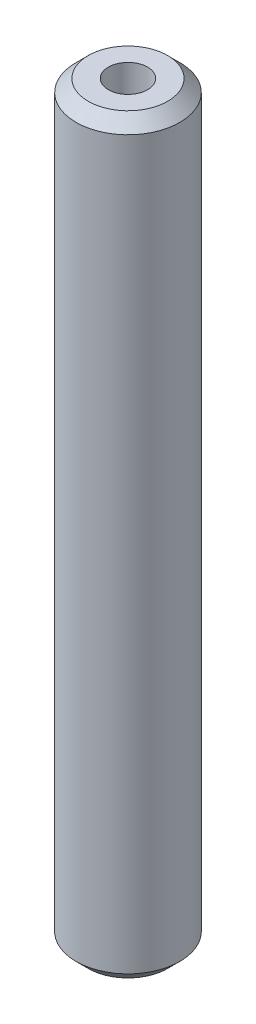
ISO-10303-21;
HEADER;
FILE_DESCRIPTION(('STEP AP214'),'2;1');
FILE_NAME('part.step','',(''),(''),'','','');
FILE_SCHEMA(('AUTOMOTIVE_DESIGN { 1 0 10303 214 1 1 1 1 }'));
ENDSEC;
DATA;
#1=APPLICATION_CONTEXT('core data for automotive mechanical design processes');
#2=APPLICATION_PROTOCOL_DEFINITION('international standard','automotive_design',2000,#1);
#3=PRODUCT_CONTEXT('',#1,'mechanical');
#4=PRODUCT('Part','Part','',(#3));
#5=PRODUCT_RELATED_PRODUCT_CATEGORY('part','',(#4));
#6=PRODUCT_DEFINITION_FORMATION('','',#4);
#7=PRODUCT_DEFINITION_CONTEXT('part definition',#1,'design');
#8=PRODUCT_DEFINITION('design','',#6,#7);
#9=PRODUCT_DEFINITION_SHAPE('','',#8);
#10=(LENGTH_UNIT() NAMED_UNIT(*) SI_UNIT(.MILLI.,.METRE.));
#11=(NAMED_UNIT(*) PLANE_ANGLE_UNIT() SI_UNIT($,.RADIAN.));
#12=(NAMED_UNIT(*) SI_UNIT($,.STERADIAN.) SOLID_ANGLE_UNIT());
#13=UNCERTAINTY_MEASURE_WITH_UNIT(LENGTH_MEASURE(1.E-05),#10,'distance_accuracy_value','');
#14=(GEOMETRIC_REPRESENTATION_CONTEXT(3) GLOBAL_UNCERTAINTY_ASSIGNED_CONTEXT((#13)) GLOBAL_UNIT_ASSIGNED_CONTEXT((#10,
#11,#12)) REPRESENTATION_CONTEXT('',''));
#15=CARTESIAN_POINT('',(0.,0.,0.));
#16=DIRECTION('',(0.,0.,1.));
#17=DIRECTION('',(1.,0.,0.));
#18=AXIS2_PLACEMENT_3D('',#15,#16,#17);
#19=CARTESIAN_POINT('',(0.,108.602294326085,0.));
#20=DIRECTION('',(0.,-1.,0.));
#21=DIRECTION('',(0.,0.,-1.));
#22=AXIS2_PLACEMENT_3D('',#19,#20,#21);
#23=CYLINDRICAL_SURFACE('',#22,7.5);
#24=CARTESIAN_POINT('',(0.,106.841260884572,0.));
#25=DIRECTION('',(0.,1.,0.));
#26=DIRECTION('',(0.,0.,1.));
#27=AXIS2_PLACEMENT_3D('',#24,#25,#26);
#28=CIRCLE('',#27,7.5);
#29=CARTESIAN_POINT('',(0.,106.841260884572,7.5));
#30=VERTEX_POINT('',#29);
#31=EDGE_CURVE('E50',#30,#30,#28,.F.);
#32=ORIENTED_EDGE('',*,*,#31,.T.);
#33=EDGE_LOOP('',(#32));
#34=FACE_BOUND('',#33,.T.);
#35=CARTESIAN_POINT('',(0.,1.76103344151311,0.));
#36=DIRECTION('',(0.,1.,0.));
#37=DIRECTION('',(0.,0.,1.));
#38=AXIS2_PLACEMENT_3D('',#35,#36,#37);
#39=CIRCLE('',#38,7.5);
#40=CARTESIAN_POINT('',(0.,1.76103344151311,7.5));
#41=VERTEX_POINT('',#40);
#42=EDGE_CURVE('E51',#41,#41,#39,.T.);
#43=ORIENTED_EDGE('',*,*,#42,.T.);
#44=EDGE_LOOP('',(#43));
#45=FACE_BOUND('',#44,.T.);
#46=ADVANCED_FACE('F39',(#34,#45),#23,.T.);
#47=CARTESIAN_POINT('',(0.,108.602294326085,0.));
#48=DIRECTION('',(0.,1.,0.));
#49=DIRECTION('',(0.,0.,1.));
#50=AXIS2_PLACEMENT_3D('',#47,#48,#49);
#51=PLANE('',#50);
#52=CARTESIAN_POINT('',(0.,108.602294326085,0.));
#53=DIRECTION('',(0.,1.,0.));
#54=DIRECTION('',(0.,0.,1.));
#55=AXIS2_PLACEMENT_3D('',#52,#53,#54);
#56=CIRCLE('',#55,5.73896655848689);
#57=CARTESIAN_POINT('',(0.,108.602294326085,5.73896655848689));
#58=VERTEX_POINT('',#57);
#59=EDGE_CURVE('E54',#58,#58,#56,.T.);
#60=ORIENTED_EDGE('',*,*,#59,.T.);
#61=EDGE_LOOP('',(#60));
#62=FACE_BOUND('',#61,.T.);
#63=CARTESIAN_POINT('',(0.,108.602294326085,0.));
#64=DIRECTION('',(0.,1.,0.));
#65=DIRECTION('',(0.,0.,1.));
#66=AXIS2_PLACEMENT_3D('',#63,#64,#65);
#67=CIRCLE('',#66,2.83714199430903);
#68=CARTESIAN_POINT('',(0.,108.602294326085,2.83714199430903));
#69=VERTEX_POINT('',#68);
#70=EDGE_CURVE('E58',#69,#69,#67,.T.);
#71=ORIENTED_EDGE('',*,*,#70,.F.);
#72=EDGE_LOOP('',(#71));
#73=FACE_BOUND('',#72,.T.);
#74=ADVANCED_FACE('F69',(#62,#73),#51,.T.);
#75=CARTESIAN_POINT('',(0.,0.,0.));
#76=DIRECTION('',(0.,1.,0.));
#77=DIRECTION('',(0.,0.,1.));
#78=AXIS2_PLACEMENT_3D('',#75,#76,#77);
#79=PLANE('',#78);
#80=CARTESIAN_POINT('',(0.,0.,0.));
#81=DIRECTION('',(0.,1.,0.));
#82=DIRECTION('',(0.,0.,1.));
#83=AXIS2_PLACEMENT_3D('',#80,#81,#82);
#84=CIRCLE('',#83,5.73896655848688);
#85=CARTESIAN_POINT('',(0.,0.,5.73896655848688));
#86=VERTEX_POINT('',#85);
#87=EDGE_CURVE('E10',#86,#86,#84,.F.);
#88=ORIENTED_EDGE('',*,*,#87,.T.);
#89=EDGE_LOOP('',(#88));
#90=FACE_BOUND('',#89,.T.);
#91=CARTESIAN_POINT('',(0.,0.,0.));
#92=DIRECTION('',(0.,1.,0.));
#93=DIRECTION('',(0.,0.,1.));
#94=AXIS2_PLACEMENT_3D('',#91,#92,#93);
#95=CIRCLE('',#94,2.83714199430903);
#96=CARTESIAN_POINT('',(0.,0.,2.83714199430903));
#97=VERTEX_POINT('',#96);
#98=EDGE_CURVE('E63',#97,#97,#95,.T.);
#99=ORIENTED_EDGE('',*,*,#98,.T.);
#100=EDGE_LOOP('',(#99));
#101=FACE_BOUND('',#100,.T.);
#102=ADVANCED_FACE('F75',(#90,#101),#79,.F.);
#103=CARTESIAN_POINT('',(0.,108.602294326085,0.));
#104=DIRECTION('',(0.,-1.,0.));
#105=DIRECTION('',(0.,0.,-1.));
#106=AXIS2_PLACEMENT_3D('',#103,#104,#105);
#107=CYLINDRICAL_SURFACE('',#106,2.83714199430903);
#108=ORIENTED_EDGE('',*,*,#70,.T.);
#109=EDGE_LOOP('',(#108));
#110=FACE_BOUND('',#109,.T.);
#111=ORIENTED_EDGE('',*,*,#98,.F.);
#112=EDGE_LOOP('',(#111));
#113=FACE_BOUND('',#112,.T.);
#114=ADVANCED_FACE('F70',(#110,#113),#107,.F.);
#115=CARTESIAN_POINT('',(0.,108.602294326085,0.));
#116=DIRECTION('',(0.,-1.,0.));
#117=DIRECTION('',(0.,0.,-1.));
#118=AXIS2_PLACEMENT_3D('',#115,#116,#117);
#119=CONICAL_SURFACE('',#118,5.73896655848689,0.785398163397442);
#120=ORIENTED_EDGE('',*,*,#31,.F.);
#121=EDGE_LOOP('',(#120));
#122=FACE_BOUND('',#121,.T.);
#123=ORIENTED_EDGE('',*,*,#59,.F.);
#124=EDGE_LOOP('',(#123));
#125=FACE_BOUND('',#124,.T.);
#126=ADVANCED_FACE('F81',(#122,#125),#119,.T.);
#127=CARTESIAN_POINT('',(0.,1.76103344151311,0.));
#128=DIRECTION('',(0.,1.,0.));
#129=DIRECTION('',(0.,0.,1.));
#130=AXIS2_PLACEMENT_3D('',#127,#128,#129);
#131=CONICAL_SURFACE('',#130,7.5,0.78539816339745);
#132=ORIENTED_EDGE('',*,*,#87,.F.);
#133=EDGE_LOOP('',(#132));
#134=FACE_BOUND('',#133,.T.);
#135=ORIENTED_EDGE('',*,*,#42,.F.);
#136=EDGE_LOOP('',(#135));
#137=FACE_BOUND('',#136,.T.);
#138=ADVANCED_FACE('F45',(#134,#137),#131,.T.);
#139=CLOSED_SHELL('',(#46,#74,#102,#114,#126,#138));
#140=MANIFOLD_SOLID_BREP('B2',#139);
#141=ADVANCED_BREP_SHAPE_REPRESENTATION('',(#18,#140),#14);
#142=SHAPE_DEFINITION_REPRESENTATION(#9,#141);
ENDSEC;
END-ISO-10303-21;
